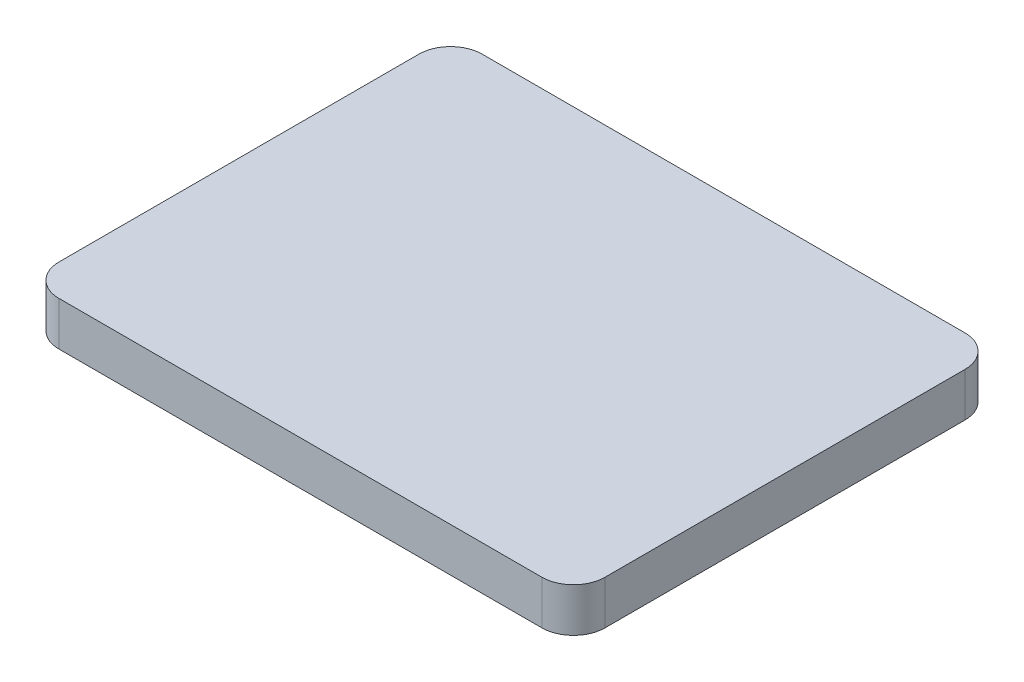
ISO-10303-21;
HEADER;
FILE_DESCRIPTION(('STEP AP214'),'2;1');
FILE_NAME('part.step','',(''),(''),'','','');
FILE_SCHEMA(('AUTOMOTIVE_DESIGN { 1 0 10303 214 1 1 1 1 }'));
ENDSEC;
DATA;
#1=APPLICATION_CONTEXT('core data for automotive mechanical design processes');
#2=APPLICATION_PROTOCOL_DEFINITION('international standard','automotive_design',2000,#1);
#3=PRODUCT_CONTEXT('',#1,'mechanical');
#4=PRODUCT('Part','Part','',(#3));
#5=PRODUCT_RELATED_PRODUCT_CATEGORY('part','',(#4));
#6=PRODUCT_DEFINITION_FORMATION('','',#4);
#7=PRODUCT_DEFINITION_CONTEXT('part definition',#1,'design');
#8=PRODUCT_DEFINITION('design','',#6,#7);
#9=PRODUCT_DEFINITION_SHAPE('','',#8);
#10=(LENGTH_UNIT() NAMED_UNIT(*) SI_UNIT(.MILLI.,.METRE.));
#11=(NAMED_UNIT(*) PLANE_ANGLE_UNIT() SI_UNIT($,.RADIAN.));
#12=(NAMED_UNIT(*) SI_UNIT($,.STERADIAN.) SOLID_ANGLE_UNIT());
#13=UNCERTAINTY_MEASURE_WITH_UNIT(LENGTH_MEASURE(1.E-05),#10,'distance_accuracy_value','');
#14=(GEOMETRIC_REPRESENTATION_CONTEXT(3) GLOBAL_UNCERTAINTY_ASSIGNED_CONTEXT((#13)) GLOBAL_UNIT_ASSIGNED_CONTEXT((#10,
#11,#12)) REPRESENTATION_CONTEXT('',''));
#15=CARTESIAN_POINT('',(0.,0.,0.));
#16=DIRECTION('',(0.,0.,1.));
#17=DIRECTION('',(1.,0.,0.));
#18=AXIS2_PLACEMENT_3D('',#15,#16,#17);
#19=CARTESIAN_POINT('',(-13.75,-2.,10.25));
#20=DIRECTION('',(0.,1.,0.));
#21=DIRECTION('',(0.,0.,1.));
#22=AXIS2_PLACEMENT_3D('',#19,#20,#21);
#23=CYLINDRICAL_SURFACE('',#22,1.);
#24=DIRECTION('',(0.,1.,0.));
#25=VECTOR('',#24,1.);
#26=CARTESIAN_POINT('',(-14.75,-2.,10.25));
#27=LINE('',#26,#25);
#28=CARTESIAN_POINT('',(-14.75,-2.,10.25));
#29=VERTEX_POINT('',#28);
#30=CARTESIAN_POINT('',(-14.75,0.,10.25));
#31=VERTEX_POINT('',#30);
#32=EDGE_CURVE('E193',#29,#31,#27,.T.);
#33=ORIENTED_EDGE('',*,*,#32,.T.);
#34=CARTESIAN_POINT('',(-13.75,0.,10.25));
#35=DIRECTION('',(0.,1.,0.));
#36=DIRECTION('',(0.,0.,1.));
#37=AXIS2_PLACEMENT_3D('',#34,#35,#36);
#38=CIRCLE('',#37,1.);
#39=CARTESIAN_POINT('',(-13.75,0.,11.25));
#40=VERTEX_POINT('',#39);
#41=EDGE_CURVE('E51',#40,#31,#38,.F.);
#42=ORIENTED_EDGE('',*,*,#41,.F.);
#43=DIRECTION('',(0.,1.,0.));
#44=VECTOR('',#43,1.);
#45=CARTESIAN_POINT('',(-13.75,-2.,11.25));
#46=LINE('',#45,#44);
#47=CARTESIAN_POINT('',(-13.75,-2.,11.25));
#48=VERTEX_POINT('',#47);
#49=EDGE_CURVE('E154',#48,#40,#46,.T.);
#50=ORIENTED_EDGE('',*,*,#49,.F.);
#51=CARTESIAN_POINT('',(-13.75,-2.,10.25));
#52=DIRECTION('',(0.,1.,0.));
#53=DIRECTION('',(0.,0.,1.));
#54=AXIS2_PLACEMENT_3D('',#51,#52,#53);
#55=CIRCLE('',#54,1.);
#56=EDGE_CURVE('E158',#29,#48,#55,.T.);
#57=ORIENTED_EDGE('',*,*,#56,.F.);
#58=EDGE_LOOP('',(#33,#42,#50,#57));
#59=FACE_BOUND('',#58,.T.);
#60=ADVANCED_FACE('F43',(#59),#23,.F.);
#61=CARTESIAN_POINT('',(-13.75,-2.,-10.25));
#62=DIRECTION('',(0.,1.,0.));
#63=DIRECTION('',(0.,0.,1.));
#64=AXIS2_PLACEMENT_3D('',#61,#62,#63);
#65=CYLINDRICAL_SURFACE('',#64,1.);
#66=DIRECTION('',(0.,1.,0.));
#67=VECTOR('',#66,1.);
#68=CARTESIAN_POINT('',(-13.75,-2.,-11.25));
#69=LINE('',#68,#67);
#70=CARTESIAN_POINT('',(-13.75,-2.,-11.25));
#71=VERTEX_POINT('',#70);
#72=CARTESIAN_POINT('',(-13.75,0.,-11.25));
#73=VERTEX_POINT('',#72);
#74=EDGE_CURVE('E199',#71,#73,#69,.T.);
#75=ORIENTED_EDGE('',*,*,#74,.T.);
#76=CARTESIAN_POINT('',(-13.75,0.,-10.25));
#77=DIRECTION('',(0.,1.,0.));
#78=DIRECTION('',(0.,0.,1.));
#79=AXIS2_PLACEMENT_3D('',#76,#77,#78);
#80=CIRCLE('',#79,1.);
#81=CARTESIAN_POINT('',(-14.75,0.,-10.25));
#82=VERTEX_POINT('',#81);
#83=EDGE_CURVE('E58',#82,#73,#80,.F.);
#84=ORIENTED_EDGE('',*,*,#83,.F.);
#85=DIRECTION('',(0.,1.,0.));
#86=VECTOR('',#85,1.);
#87=CARTESIAN_POINT('',(-14.75,-2.,-10.25));
#88=LINE('',#87,#86);
#89=CARTESIAN_POINT('',(-14.75,-2.,-10.25));
#90=VERTEX_POINT('',#89);
#91=EDGE_CURVE('E196',#90,#82,#88,.T.);
#92=ORIENTED_EDGE('',*,*,#91,.F.);
#93=CARTESIAN_POINT('',(-13.75,-2.,-10.25));
#94=DIRECTION('',(0.,1.,0.));
#95=DIRECTION('',(0.,0.,1.));
#96=AXIS2_PLACEMENT_3D('',#93,#94,#95);
#97=CIRCLE('',#96,1.);
#98=EDGE_CURVE('E190',#71,#90,#97,.T.);
#99=ORIENTED_EDGE('',*,*,#98,.F.);
#100=EDGE_LOOP('',(#75,#84,#92,#99));
#101=FACE_BOUND('',#100,.T.);
#102=ADVANCED_FACE('F290',(#101),#65,.F.);
#103=CARTESIAN_POINT('',(13.75,-2.,-10.25));
#104=DIRECTION('',(0.,1.,0.));
#105=DIRECTION('',(0.,0.,1.));
#106=AXIS2_PLACEMENT_3D('',#103,#104,#105);
#107=CYLINDRICAL_SURFACE('',#106,1.);
#108=DIRECTION('',(0.,1.,0.));
#109=VECTOR('',#108,1.);
#110=CARTESIAN_POINT('',(14.75,-2.,-10.25));
#111=LINE('',#110,#109);
#112=CARTESIAN_POINT('',(14.75,-2.,-10.25));
#113=VERTEX_POINT('',#112);
#114=CARTESIAN_POINT('',(14.75,0.,-10.25));
#115=VERTEX_POINT('',#114);
#116=EDGE_CURVE('E205',#113,#115,#111,.T.);
#117=ORIENTED_EDGE('',*,*,#116,.T.);
#118=CARTESIAN_POINT('',(13.75,0.,-10.25));
#119=DIRECTION('',(0.,1.,0.));
#120=DIRECTION('',(0.,0.,1.));
#121=AXIS2_PLACEMENT_3D('',#118,#119,#120);
#122=CIRCLE('',#121,1.);
#123=CARTESIAN_POINT('',(13.75,0.,-11.25));
#124=VERTEX_POINT('',#123);
#125=EDGE_CURVE('E284',#124,#115,#122,.F.);
#126=ORIENTED_EDGE('',*,*,#125,.F.);
#127=DIRECTION('',(0.,1.,0.));
#128=VECTOR('',#127,1.);
#129=CARTESIAN_POINT('',(13.75,-2.,-11.25));
#130=LINE('',#129,#128);
#131=CARTESIAN_POINT('',(13.75,-2.,-11.25));
#132=VERTEX_POINT('',#131);
#133=EDGE_CURVE('E202',#132,#124,#130,.T.);
#134=ORIENTED_EDGE('',*,*,#133,.F.);
#135=CARTESIAN_POINT('',(13.75,-2.,-10.25));
#136=DIRECTION('',(0.,1.,0.));
#137=DIRECTION('',(0.,0.,1.));
#138=AXIS2_PLACEMENT_3D('',#135,#136,#137);
#139=CIRCLE('',#138,1.);
#140=EDGE_CURVE('E184',#113,#132,#139,.T.);
#141=ORIENTED_EDGE('',*,*,#140,.F.);
#142=EDGE_LOOP('',(#117,#126,#134,#141));
#143=FACE_BOUND('',#142,.T.);
#144=ADVANCED_FACE('F296',(#143),#107,.F.);
#145=CARTESIAN_POINT('',(13.75,-2.,10.25));
#146=DIRECTION('',(0.,1.,0.));
#147=DIRECTION('',(0.,0.,1.));
#148=AXIS2_PLACEMENT_3D('',#145,#146,#147);
#149=CYLINDRICAL_SURFACE('',#148,1.);
#150=DIRECTION('',(0.,1.,0.));
#151=VECTOR('',#150,1.);
#152=CARTESIAN_POINT('',(13.75,-2.,11.25));
#153=LINE('',#152,#151);
#154=CARTESIAN_POINT('',(13.75,-2.,11.25));
#155=VERTEX_POINT('',#154);
#156=CARTESIAN_POINT('',(13.75,0.,11.25));
#157=VERTEX_POINT('',#156);
#158=EDGE_CURVE('E162',#155,#157,#153,.T.);
#159=ORIENTED_EDGE('',*,*,#158,.T.);
#160=CARTESIAN_POINT('',(13.75,0.,10.25));
#161=DIRECTION('',(0.,1.,0.));
#162=DIRECTION('',(0.,0.,1.));
#163=AXIS2_PLACEMENT_3D('',#160,#161,#162);
#164=CIRCLE('',#163,1.);
#165=CARTESIAN_POINT('',(14.75,0.,10.25));
#166=VERTEX_POINT('',#165);
#167=EDGE_CURVE('E11',#166,#157,#164,.F.);
#168=ORIENTED_EDGE('',*,*,#167,.F.);
#169=DIRECTION('',(0.,1.,0.));
#170=VECTOR('',#169,1.);
#171=CARTESIAN_POINT('',(14.75,-2.,10.25));
#172=LINE('',#171,#170);
#173=CARTESIAN_POINT('',(14.75,-2.,10.25));
#174=VERTEX_POINT('',#173);
#175=EDGE_CURVE('E208',#174,#166,#172,.T.);
#176=ORIENTED_EDGE('',*,*,#175,.F.);
#177=CARTESIAN_POINT('',(13.75,-2.,10.25));
#178=DIRECTION('',(0.,1.,0.));
#179=DIRECTION('',(0.,0.,1.));
#180=AXIS2_PLACEMENT_3D('',#177,#178,#179);
#181=CIRCLE('',#180,1.);
#182=EDGE_CURVE('E172',#155,#174,#181,.T.);
#183=ORIENTED_EDGE('',*,*,#182,.F.);
#184=EDGE_LOOP('',(#159,#168,#176,#183));
#185=FACE_BOUND('',#184,.T.);
#186=ADVANCED_FACE('F302',(#185),#149,.F.);
#187=CARTESIAN_POINT('',(-13.75,-2.,11.25));
#188=DIRECTION('',(0.,0.,1.));
#189=DIRECTION('',(1.,0.,0.));
#190=AXIS2_PLACEMENT_3D('',#187,#188,#189);
#191=PLANE('',#190);
#192=ORIENTED_EDGE('',*,*,#49,.T.);
#193=DIRECTION('',(1.,0.,0.));
#194=VECTOR('',#193,1.);
#195=CARTESIAN_POINT('',(-14.75,0.,11.25));
#196=LINE('',#195,#194);
#197=EDGE_CURVE('E282',#40,#157,#196,.T.);
#198=ORIENTED_EDGE('',*,*,#197,.T.);
#199=ORIENTED_EDGE('',*,*,#158,.F.);
#200=DIRECTION('',(1.,0.,0.));
#201=VECTOR('',#200,1.);
#202=CARTESIAN_POINT('',(-13.75,-2.,11.25));
#203=LINE('',#202,#201);
#204=EDGE_CURVE('E167',#48,#155,#203,.T.);
#205=ORIENTED_EDGE('',*,*,#204,.F.);
#206=EDGE_LOOP('',(#192,#198,#199,#205));
#207=FACE_BOUND('',#206,.T.);
#208=ADVANCED_FACE('F168',(#207),#191,.F.);
#209=CARTESIAN_POINT('',(-14.75,-2.,-10.25));
#210=DIRECTION('',(-1.,0.,0.));
#211=DIRECTION('',(0.,0.,1.));
#212=AXIS2_PLACEMENT_3D('',#209,#210,#211);
#213=PLANE('',#212);
#214=ORIENTED_EDGE('',*,*,#91,.T.);
#215=DIRECTION('',(0.,0.,1.));
#216=VECTOR('',#215,1.);
#217=CARTESIAN_POINT('',(-14.75,0.,-11.25));
#218=LINE('',#217,#216);
#219=EDGE_CURVE('E279',#82,#31,#218,.T.);
#220=ORIENTED_EDGE('',*,*,#219,.T.);
#221=ORIENTED_EDGE('',*,*,#32,.F.);
#222=DIRECTION('',(0.,0.,1.));
#223=VECTOR('',#222,1.);
#224=CARTESIAN_POINT('',(-14.75,-2.,-10.25));
#225=LINE('',#224,#223);
#226=EDGE_CURVE('E163',#90,#29,#225,.T.);
#227=ORIENTED_EDGE('',*,*,#226,.F.);
#228=EDGE_LOOP('',(#214,#220,#221,#227));
#229=FACE_BOUND('',#228,.T.);
#230=ADVANCED_FACE('F287',(#229),#213,.F.);
#231=CARTESIAN_POINT('',(13.75,-2.,-11.25));
#232=DIRECTION('',(0.,0.,-1.));
#233=DIRECTION('',(-1.,0.,0.));
#234=AXIS2_PLACEMENT_3D('',#231,#232,#233);
#235=PLANE('',#234);
#236=ORIENTED_EDGE('',*,*,#133,.T.);
#237=DIRECTION('',(-1.,0.,0.));
#238=VECTOR('',#237,1.);
#239=CARTESIAN_POINT('',(-14.75,0.,-11.25));
#240=LINE('',#239,#238);
#241=EDGE_CURVE('E62',#124,#73,#240,.T.);
#242=ORIENTED_EDGE('',*,*,#241,.T.);
#243=ORIENTED_EDGE('',*,*,#74,.F.);
#244=DIRECTION('',(-1.,0.,0.));
#245=VECTOR('',#244,1.);
#246=CARTESIAN_POINT('',(13.75,-2.,-11.25));
#247=LINE('',#246,#245);
#248=EDGE_CURVE('E187',#132,#71,#247,.T.);
#249=ORIENTED_EDGE('',*,*,#248,.F.);
#250=EDGE_LOOP('',(#236,#242,#243,#249));
#251=FACE_BOUND('',#250,.T.);
#252=ADVANCED_FACE('F293',(#251),#235,.F.);
#253=CARTESIAN_POINT('',(14.75,-2.,10.25));
#254=DIRECTION('',(1.,0.,0.));
#255=DIRECTION('',(0.,0.,-1.));
#256=AXIS2_PLACEMENT_3D('',#253,#254,#255);
#257=PLANE('',#256);
#258=ORIENTED_EDGE('',*,*,#175,.T.);
#259=DIRECTION('',(0.,0.,-1.));
#260=VECTOR('',#259,1.);
#261=CARTESIAN_POINT('',(14.75,0.,-11.25));
#262=LINE('',#261,#260);
#263=EDGE_CURVE('E262',#166,#115,#262,.T.);
#264=ORIENTED_EDGE('',*,*,#263,.T.);
#265=ORIENTED_EDGE('',*,*,#116,.F.);
#266=DIRECTION('',(0.,0.,-1.));
#267=VECTOR('',#266,1.);
#268=CARTESIAN_POINT('',(14.75,-2.,10.25));
#269=LINE('',#268,#267);
#270=EDGE_CURVE('E181',#174,#113,#269,.T.);
#271=ORIENTED_EDGE('',*,*,#270,.F.);
#272=EDGE_LOOP('',(#258,#264,#265,#271));
#273=FACE_BOUND('',#272,.T.);
#274=ADVANCED_FACE('F299',(#273),#257,.F.);
#275=CARTESIAN_POINT('',(-13.75,-2.,10.25));
#276=DIRECTION('',(0.,1.,0.));
#277=DIRECTION('',(0.,0.,1.));
#278=AXIS2_PLACEMENT_3D('',#275,#276,#277);
#279=CYLINDRICAL_SURFACE('',#278,1.8);
#280=CARTESIAN_POINT('',(-13.75,0.5,10.25));
#281=DIRECTION('',(0.,1.,0.));
#282=DIRECTION('',(0.,0.,1.));
#283=AXIS2_PLACEMENT_3D('',#280,#281,#282);
#284=CIRCLE('',#283,1.8);
#285=CARTESIAN_POINT('',(-15.55,0.5,10.25));
#286=VERTEX_POINT('',#285);
#287=CARTESIAN_POINT('',(-13.75,0.5,12.05));
#288=VERTEX_POINT('',#287);
#289=EDGE_CURVE('E195',#286,#288,#284,.T.);
#290=ORIENTED_EDGE('',*,*,#289,.F.);
#291=DIRECTION('',(0.,1.,0.));
#292=VECTOR('',#291,1.);
#293=CARTESIAN_POINT('',(-15.55,-2.,10.25));
#294=LINE('',#293,#292);
#295=CARTESIAN_POINT('',(-15.55,-2.,10.25));
#296=VERTEX_POINT('',#295);
#297=EDGE_CURVE('E260',#296,#286,#294,.T.);
#298=ORIENTED_EDGE('',*,*,#297,.F.);
#299=CARTESIAN_POINT('',(-13.75,-2.,10.25));
#300=DIRECTION('',(0.,1.,0.));
#301=DIRECTION('',(0.,0.,1.));
#302=AXIS2_PLACEMENT_3D('',#299,#300,#301);
#303=CIRCLE('',#302,1.8);
#304=CARTESIAN_POINT('',(-13.75,-2.,12.05));
#305=VERTEX_POINT('',#304);
#306=EDGE_CURVE('E212',#296,#305,#303,.T.);
#307=ORIENTED_EDGE('',*,*,#306,.T.);
#308=DIRECTION('',(0.,1.,0.));
#309=VECTOR('',#308,1.);
#310=CARTESIAN_POINT('',(-13.75,-2.,12.05));
#311=LINE('',#310,#309);
#312=EDGE_CURVE('E237',#305,#288,#311,.T.);
#313=ORIENTED_EDGE('',*,*,#312,.T.);
#314=EDGE_LOOP('',(#290,#298,#307,#313));
#315=FACE_BOUND('',#314,.T.);
#316=ADVANCED_FACE('F327',(#315),#279,.T.);
#317=CARTESIAN_POINT('',(-15.55,-2.,-10.25));
#318=DIRECTION('',(-1.,0.,0.));
#319=DIRECTION('',(0.,0.,1.));
#320=AXIS2_PLACEMENT_3D('',#317,#318,#319);
#321=PLANE('',#320);
#322=DIRECTION('',(0.,0.,1.));
#323=VECTOR('',#322,1.);
#324=CARTESIAN_POINT('',(-15.55,0.5,-10.25));
#325=LINE('',#324,#323);
#326=CARTESIAN_POINT('',(-15.55,0.5,-10.25));
#327=VERTEX_POINT('',#326);
#328=EDGE_CURVE('E216',#327,#286,#325,.T.);
#329=ORIENTED_EDGE('',*,*,#328,.F.);
#330=DIRECTION('',(0.,1.,0.));
#331=VECTOR('',#330,1.);
#332=CARTESIAN_POINT('',(-15.55,-2.,-10.25));
#333=LINE('',#332,#331);
#334=CARTESIAN_POINT('',(-15.55,-2.,-10.25));
#335=VERTEX_POINT('',#334);
#336=EDGE_CURVE('E263',#335,#327,#333,.T.);
#337=ORIENTED_EDGE('',*,*,#336,.F.);
#338=DIRECTION('',(0.,0.,1.));
#339=VECTOR('',#338,1.);
#340=CARTESIAN_POINT('',(-15.55,-2.,-10.25));
#341=LINE('',#340,#339);
#342=EDGE_CURVE('E234',#335,#296,#341,.T.);
#343=ORIENTED_EDGE('',*,*,#342,.T.);
#344=ORIENTED_EDGE('',*,*,#297,.T.);
#345=EDGE_LOOP('',(#329,#337,#343,#344));
#346=FACE_BOUND('',#345,.T.);
#347=ADVANCED_FACE('F323',(#346),#321,.T.);
#348=CARTESIAN_POINT('',(-13.75,-2.,-10.25));
#349=DIRECTION('',(0.,1.,0.));
#350=DIRECTION('',(0.,0.,1.));
#351=AXIS2_PLACEMENT_3D('',#348,#349,#350);
#352=CYLINDRICAL_SURFACE('',#351,1.8);
#353=CARTESIAN_POINT('',(-13.75,0.5,-10.25));
#354=DIRECTION('',(0.,1.,0.));
#355=DIRECTION('',(0.,0.,1.));
#356=AXIS2_PLACEMENT_3D('',#353,#354,#355);
#357=CIRCLE('',#356,1.8);
#358=CARTESIAN_POINT('',(-13.75,0.5,-12.05));
#359=VERTEX_POINT('',#358);
#360=EDGE_CURVE('E255',#359,#327,#357,.T.);
#361=ORIENTED_EDGE('',*,*,#360,.F.);
#362=DIRECTION('',(0.,1.,0.));
#363=VECTOR('',#362,1.);
#364=CARTESIAN_POINT('',(-13.75,-2.,-12.05));
#365=LINE('',#364,#363);
#366=CARTESIAN_POINT('',(-13.75,-2.,-12.05));
#367=VERTEX_POINT('',#366);
#368=EDGE_CURVE('E265',#367,#359,#365,.T.);
#369=ORIENTED_EDGE('',*,*,#368,.F.);
#370=CARTESIAN_POINT('',(-13.75,-2.,-10.25));
#371=DIRECTION('',(0.,1.,0.));
#372=DIRECTION('',(0.,0.,1.));
#373=AXIS2_PLACEMENT_3D('',#370,#371,#372);
#374=CIRCLE('',#373,1.8);
#375=EDGE_CURVE('E231',#367,#335,#374,.T.);
#376=ORIENTED_EDGE('',*,*,#375,.T.);
#377=ORIENTED_EDGE('',*,*,#336,.T.);
#378=EDGE_LOOP('',(#361,#369,#376,#377));
#379=FACE_BOUND('',#378,.T.);
#380=ADVANCED_FACE('F326',(#379),#352,.T.);
#381=CARTESIAN_POINT('',(13.75,-2.,-12.05));
#382=DIRECTION('',(0.,0.,-1.));
#383=DIRECTION('',(-1.,0.,0.));
#384=AXIS2_PLACEMENT_3D('',#381,#382,#383);
#385=PLANE('',#384);
#386=DIRECTION('',(-1.,0.,0.));
#387=VECTOR('',#386,1.);
#388=CARTESIAN_POINT('',(13.75,0.5,-12.05));
#389=LINE('',#388,#387);
#390=CARTESIAN_POINT('',(13.75,0.5,-12.05));
#391=VERTEX_POINT('',#390);
#392=EDGE_CURVE('E252',#391,#359,#389,.T.);
#393=ORIENTED_EDGE('',*,*,#392,.F.);
#394=DIRECTION('',(0.,1.,0.));
#395=VECTOR('',#394,1.);
#396=CARTESIAN_POINT('',(13.75,-2.,-12.05));
#397=LINE('',#396,#395);
#398=CARTESIAN_POINT('',(13.75,-2.,-12.05));
#399=VERTEX_POINT('',#398);
#400=EDGE_CURVE('E267',#399,#391,#397,.T.);
#401=ORIENTED_EDGE('',*,*,#400,.F.);
#402=DIRECTION('',(-1.,0.,0.));
#403=VECTOR('',#402,1.);
#404=CARTESIAN_POINT('',(13.75,-2.,-12.05));
#405=LINE('',#404,#403);
#406=EDGE_CURVE('E228',#399,#367,#405,.T.);
#407=ORIENTED_EDGE('',*,*,#406,.T.);
#408=ORIENTED_EDGE('',*,*,#368,.T.);
#409=EDGE_LOOP('',(#393,#401,#407,#408));
#410=FACE_BOUND('',#409,.T.);
#411=ADVANCED_FACE('F331',(#410),#385,.T.);
#412=CARTESIAN_POINT('',(13.75,-2.,-10.25));
#413=DIRECTION('',(0.,1.,0.));
#414=DIRECTION('',(0.,0.,1.));
#415=AXIS2_PLACEMENT_3D('',#412,#413,#414);
#416=CYLINDRICAL_SURFACE('',#415,1.8);
#417=CARTESIAN_POINT('',(13.75,0.5,-10.25));
#418=DIRECTION('',(0.,1.,0.));
#419=DIRECTION('',(0.,0.,1.));
#420=AXIS2_PLACEMENT_3D('',#417,#418,#419);
#421=CIRCLE('',#420,1.8);
#422=CARTESIAN_POINT('',(15.55,0.5,-10.25));
#423=VERTEX_POINT('',#422);
#424=EDGE_CURVE('E249',#423,#391,#421,.T.);
#425=ORIENTED_EDGE('',*,*,#424,.F.);
#426=DIRECTION('',(0.,1.,0.));
#427=VECTOR('',#426,1.);
#428=CARTESIAN_POINT('',(15.55,-2.,-10.25));
#429=LINE('',#428,#427);
#430=CARTESIAN_POINT('',(15.55,-2.,-10.25));
#431=VERTEX_POINT('',#430);
#432=EDGE_CURVE('E269',#431,#423,#429,.T.);
#433=ORIENTED_EDGE('',*,*,#432,.F.);
#434=CARTESIAN_POINT('',(13.75,-2.,-10.25));
#435=DIRECTION('',(0.,1.,0.));
#436=DIRECTION('',(0.,0.,1.));
#437=AXIS2_PLACEMENT_3D('',#434,#435,#436);
#438=CIRCLE('',#437,1.8);
#439=EDGE_CURVE('E225',#431,#399,#438,.T.);
#440=ORIENTED_EDGE('',*,*,#439,.T.);
#441=ORIENTED_EDGE('',*,*,#400,.T.);
#442=EDGE_LOOP('',(#425,#433,#440,#441));
#443=FACE_BOUND('',#442,.T.);
#444=ADVANCED_FACE('F335',(#443),#416,.T.);
#445=CARTESIAN_POINT('',(15.55,-2.,10.25));
#446=DIRECTION('',(1.,0.,0.));
#447=DIRECTION('',(0.,0.,-1.));
#448=AXIS2_PLACEMENT_3D('',#445,#446,#447);
#449=PLANE('',#448);
#450=DIRECTION('',(0.,0.,-1.));
#451=VECTOR('',#450,1.);
#452=CARTESIAN_POINT('',(15.55,0.5,10.25));
#453=LINE('',#452,#451);
#454=CARTESIAN_POINT('',(15.55,0.5,10.25));
#455=VERTEX_POINT('',#454);
#456=EDGE_CURVE('E246',#455,#423,#453,.T.);
#457=ORIENTED_EDGE('',*,*,#456,.F.);
#458=DIRECTION('',(0.,1.,0.));
#459=VECTOR('',#458,1.);
#460=CARTESIAN_POINT('',(15.55,-2.,10.25));
#461=LINE('',#460,#459);
#462=CARTESIAN_POINT('',(15.55,-2.,10.25));
#463=VERTEX_POINT('',#462);
#464=EDGE_CURVE('E271',#463,#455,#461,.T.);
#465=ORIENTED_EDGE('',*,*,#464,.F.);
#466=DIRECTION('',(0.,0.,-1.));
#467=VECTOR('',#466,1.);
#468=CARTESIAN_POINT('',(15.55,-2.,10.25));
#469=LINE('',#468,#467);
#470=EDGE_CURVE('E222',#463,#431,#469,.T.);
#471=ORIENTED_EDGE('',*,*,#470,.T.);
#472=ORIENTED_EDGE('',*,*,#432,.T.);
#473=EDGE_LOOP('',(#457,#465,#471,#472));
#474=FACE_BOUND('',#473,.T.);
#475=ADVANCED_FACE('F339',(#474),#449,.T.);
#476=CARTESIAN_POINT('',(13.75,-2.,10.25));
#477=DIRECTION('',(0.,1.,0.));
#478=DIRECTION('',(0.,0.,1.));
#479=AXIS2_PLACEMENT_3D('',#476,#477,#478);
#480=CYLINDRICAL_SURFACE('',#479,1.8);
#481=CARTESIAN_POINT('',(13.75,0.5,10.25));
#482=DIRECTION('',(0.,1.,0.));
#483=DIRECTION('',(0.,0.,1.));
#484=AXIS2_PLACEMENT_3D('',#481,#482,#483);
#485=CIRCLE('',#484,1.8);
#486=CARTESIAN_POINT('',(13.75,0.5,12.05));
#487=VERTEX_POINT('',#486);
#488=EDGE_CURVE('E243',#487,#455,#485,.T.);
#489=ORIENTED_EDGE('',*,*,#488,.F.);
#490=DIRECTION('',(0.,1.,0.));
#491=VECTOR('',#490,1.);
#492=CARTESIAN_POINT('',(13.75,-2.,12.05));
#493=LINE('',#492,#491);
#494=CARTESIAN_POINT('',(13.75,-2.,12.05));
#495=VERTEX_POINT('',#494);
#496=EDGE_CURVE('E273',#495,#487,#493,.T.);
#497=ORIENTED_EDGE('',*,*,#496,.F.);
#498=CARTESIAN_POINT('',(13.75,-2.,10.25));
#499=DIRECTION('',(0.,1.,0.));
#500=DIRECTION('',(0.,0.,1.));
#501=AXIS2_PLACEMENT_3D('',#498,#499,#500);
#502=CIRCLE('',#501,1.8);
#503=EDGE_CURVE('E219',#495,#463,#502,.T.);
#504=ORIENTED_EDGE('',*,*,#503,.T.);
#505=ORIENTED_EDGE('',*,*,#464,.T.);
#506=EDGE_LOOP('',(#489,#497,#504,#505));
#507=FACE_BOUND('',#506,.T.);
#508=ADVANCED_FACE('F343',(#507),#480,.T.);
#509=CARTESIAN_POINT('',(-13.75,-2.,12.05));
#510=DIRECTION('',(0.,0.,1.));
#511=DIRECTION('',(1.,0.,0.));
#512=AXIS2_PLACEMENT_3D('',#509,#510,#511);
#513=PLANE('',#512);
#514=DIRECTION('',(1.,0.,0.));
#515=VECTOR('',#514,1.);
#516=CARTESIAN_POINT('',(-13.75,0.5,12.05));
#517=LINE('',#516,#515);
#518=EDGE_CURVE('E240',#288,#487,#517,.T.);
#519=ORIENTED_EDGE('',*,*,#518,.F.);
#520=ORIENTED_EDGE('',*,*,#312,.F.);
#521=DIRECTION('',(1.,0.,0.));
#522=VECTOR('',#521,1.);
#523=CARTESIAN_POINT('',(-13.75,-2.,12.05));
#524=LINE('',#523,#522);
#525=EDGE_CURVE('E215',#305,#495,#524,.T.);
#526=ORIENTED_EDGE('',*,*,#525,.T.);
#527=ORIENTED_EDGE('',*,*,#496,.T.);
#528=EDGE_LOOP('',(#519,#520,#526,#527));
#529=FACE_BOUND('',#528,.T.);
#530=ADVANCED_FACE('F322',(#529),#513,.T.);
#531=CARTESIAN_POINT('',(-13.75,-2.,10.25));
#532=DIRECTION('',(0.,1.,0.));
#533=DIRECTION('',(0.,0.,1.));
#534=AXIS2_PLACEMENT_3D('',#531,#532,#533);
#535=PLANE('',#534);
#536=ORIENTED_EDGE('',*,*,#226,.T.);
#537=ORIENTED_EDGE('',*,*,#56,.T.);
#538=ORIENTED_EDGE('',*,*,#204,.T.);
#539=ORIENTED_EDGE('',*,*,#182,.T.);
#540=ORIENTED_EDGE('',*,*,#270,.T.);
#541=ORIENTED_EDGE('',*,*,#140,.T.);
#542=ORIENTED_EDGE('',*,*,#248,.T.);
#543=ORIENTED_EDGE('',*,*,#98,.T.);
#544=EDGE_LOOP('',(#536,#537,#538,#539,#540,#541,#542,#543));
#545=FACE_BOUND('',#544,.T.);
#546=ORIENTED_EDGE('',*,*,#306,.F.);
#547=ORIENTED_EDGE('',*,*,#342,.F.);
#548=ORIENTED_EDGE('',*,*,#375,.F.);
#549=ORIENTED_EDGE('',*,*,#406,.F.);
#550=ORIENTED_EDGE('',*,*,#439,.F.);
#551=ORIENTED_EDGE('',*,*,#470,.F.);
#552=ORIENTED_EDGE('',*,*,#503,.F.);
#553=ORIENTED_EDGE('',*,*,#525,.F.);
#554=EDGE_LOOP('',(#546,#547,#548,#549,#550,#551,#552,#553));
#555=FACE_BOUND('',#554,.T.);
#556=ADVANCED_FACE('F174',(#545,#555),#535,.F.);
#557=CARTESIAN_POINT('',(0.,0.5,0.));
#558=DIRECTION('',(0.,1.,0.));
#559=DIRECTION('',(0.,0.,1.));
#560=AXIS2_PLACEMENT_3D('',#557,#558,#559);
#561=PLANE('',#560);
#562=ORIENTED_EDGE('',*,*,#289,.T.);
#563=ORIENTED_EDGE('',*,*,#518,.T.);
#564=ORIENTED_EDGE('',*,*,#488,.T.);
#565=ORIENTED_EDGE('',*,*,#456,.T.);
#566=ORIENTED_EDGE('',*,*,#424,.T.);
#567=ORIENTED_EDGE('',*,*,#392,.T.);
#568=ORIENTED_EDGE('',*,*,#360,.T.);
#569=ORIENTED_EDGE('',*,*,#328,.T.);
#570=EDGE_LOOP('',(#562,#563,#564,#565,#566,#567,#568,#569));
#571=FACE_BOUND('',#570,.T.);
#572=ADVANCED_FACE('F321',(#571),#561,.T.);
#573=CARTESIAN_POINT('',(0.,0.,0.));
#574=DIRECTION('',(0.,1.,0.));
#575=DIRECTION('',(0.,0.,1.));
#576=AXIS2_PLACEMENT_3D('',#573,#574,#575);
#577=PLANE('',#576);
#578=ORIENTED_EDGE('',*,*,#263,.F.);
#579=ORIENTED_EDGE('',*,*,#167,.T.);
#580=ORIENTED_EDGE('',*,*,#197,.F.);
#581=ORIENTED_EDGE('',*,*,#41,.T.);
#582=ORIENTED_EDGE('',*,*,#219,.F.);
#583=ORIENTED_EDGE('',*,*,#83,.T.);
#584=ORIENTED_EDGE('',*,*,#241,.F.);
#585=ORIENTED_EDGE('',*,*,#125,.T.);
#586=EDGE_LOOP('',(#578,#579,#580,#581,#582,#583,#584,#585));
#587=FACE_BOUND('',#586,.T.);
#588=ADVANCED_FACE('F45',(#587),#577,.F.);
#589=CLOSED_SHELL('',(#60,#102,#144,#186,#208,#230,#252,#274,#316,#347,#380,#411,#444,#475,#508,
#530,#556,#572,#588));
#590=MANIFOLD_SOLID_BREP('B2',#589);
#591=ADVANCED_BREP_SHAPE_REPRESENTATION('',(#18,#590),#14);
#592=SHAPE_DEFINITION_REPRESENTATION(#9,#591);
ENDSEC;
END-ISO-10303-21;
